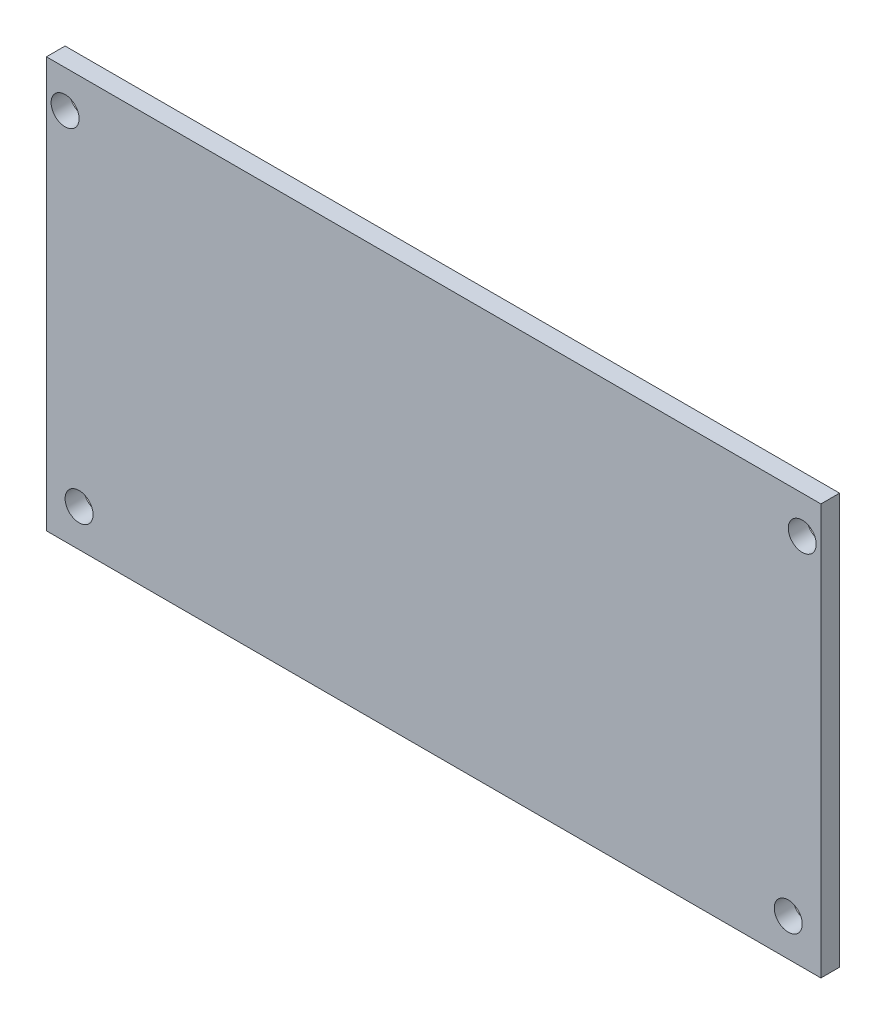
ISO-10303-21;
HEADER;
FILE_DESCRIPTION(('STEP AP214'),'2;1');
FILE_NAME('part.step','',(''),(''),'','','');
FILE_SCHEMA(('AUTOMOTIVE_DESIGN { 1 0 10303 214 1 1 1 1 }'));
ENDSEC;
DATA;
#1=APPLICATION_CONTEXT('core data for automotive mechanical design processes');
#2=APPLICATION_PROTOCOL_DEFINITION('international standard','automotive_design',2000,#1);
#3=PRODUCT_CONTEXT('',#1,'mechanical');
#4=PRODUCT('Part','Part','',(#3));
#5=PRODUCT_RELATED_PRODUCT_CATEGORY('part','',(#4));
#6=PRODUCT_DEFINITION_FORMATION('','',#4);
#7=PRODUCT_DEFINITION_CONTEXT('part definition',#1,'design');
#8=PRODUCT_DEFINITION('design','',#6,#7);
#9=PRODUCT_DEFINITION_SHAPE('','',#8);
#10=(LENGTH_UNIT() NAMED_UNIT(*) SI_UNIT(.MILLI.,.METRE.));
#11=(NAMED_UNIT(*) PLANE_ANGLE_UNIT() SI_UNIT($,.RADIAN.));
#12=(NAMED_UNIT(*) SI_UNIT($,.STERADIAN.) SOLID_ANGLE_UNIT());
#13=UNCERTAINTY_MEASURE_WITH_UNIT(LENGTH_MEASURE(1.E-05),#10,'distance_accuracy_value','');
#14=(GEOMETRIC_REPRESENTATION_CONTEXT(3) GLOBAL_UNCERTAINTY_ASSIGNED_CONTEXT((#13)) GLOBAL_UNIT_ASSIGNED_CONTEXT((#10,
#11,#12)) REPRESENTATION_CONTEXT('',''));
#15=CARTESIAN_POINT('',(0.,0.,0.));
#16=DIRECTION('',(0.,0.,1.));
#17=DIRECTION('',(1.,0.,0.));
#18=AXIS2_PLACEMENT_3D('',#15,#16,#17);
#19=CARTESIAN_POINT('',(0.,44.,2.));
#20=DIRECTION('',(0.,0.,1.));
#21=DIRECTION('',(1.,0.,0.));
#22=AXIS2_PLACEMENT_3D('',#19,#20,#21);
#23=PLANE('',#22);
#24=CARTESIAN_POINT('',(-3.49999999999998,4.00000000000001,2.));
#25=DIRECTION('',(0.,0.,-1.));
#26=DIRECTION('',(-1.,0.,0.));
#27=AXIS2_PLACEMENT_3D('',#24,#25,#26);
#28=CIRCLE('',#27,1.5);
#29=CARTESIAN_POINT('',(-4.99999999999998,4.00000000000001,2.));
#30=VERTEX_POINT('',#29);
#31=EDGE_CURVE('E114',#30,#30,#28,.T.);
#32=ORIENTED_EDGE('',*,*,#31,.T.);
#33=EDGE_LOOP('',(#32));
#34=FACE_BOUND('',#33,.T.);
#35=CARTESIAN_POINT('',(-81.,40.,2.));
#36=DIRECTION('',(0.,0.,-1.));
#37=DIRECTION('',(-1.,0.,0.));
#38=AXIS2_PLACEMENT_3D('',#35,#36,#37);
#39=CIRCLE('',#38,1.5);
#40=CARTESIAN_POINT('',(-82.5,40.,2.));
#41=VERTEX_POINT('',#40);
#42=EDGE_CURVE('E91',#41,#41,#39,.T.);
#43=ORIENTED_EDGE('',*,*,#42,.T.);
#44=EDGE_LOOP('',(#43));
#45=FACE_BOUND('',#44,.T.);
#46=DIRECTION('',(0.,1.,0.));
#47=VECTOR('',#46,1.);
#48=CARTESIAN_POINT('',(0.,0.,2.));
#49=LINE('',#48,#47);
#50=CARTESIAN_POINT('',(0.,0.,2.));
#51=VERTEX_POINT('',#50);
#52=CARTESIAN_POINT('',(0.,44.,2.));
#53=VERTEX_POINT('',#52);
#54=EDGE_CURVE('E99',#51,#53,#49,.T.);
#55=ORIENTED_EDGE('',*,*,#54,.T.);
#56=DIRECTION('',(-1.,0.,0.));
#57=VECTOR('',#56,1.);
#58=CARTESIAN_POINT('',(0.,44.,2.));
#59=LINE('',#58,#57);
#60=CARTESIAN_POINT('',(-83.,44.,2.));
#61=VERTEX_POINT('',#60);
#62=EDGE_CURVE('E83',#53,#61,#59,.T.);
#63=ORIENTED_EDGE('',*,*,#62,.T.);
#64=DIRECTION('',(0.,-1.,0.));
#65=VECTOR('',#64,1.);
#66=CARTESIAN_POINT('',(-83.,0.,2.));
#67=LINE('',#66,#65);
#68=CARTESIAN_POINT('',(-83.,0.,2.));
#69=VERTEX_POINT('',#68);
#70=EDGE_CURVE('E49',#61,#69,#67,.T.);
#71=ORIENTED_EDGE('',*,*,#70,.T.);
#72=DIRECTION('',(1.,0.,0.));
#73=VECTOR('',#72,1.);
#74=CARTESIAN_POINT('',(0.,0.,2.));
#75=LINE('',#74,#73);
#76=EDGE_CURVE('E44',#69,#51,#75,.T.);
#77=ORIENTED_EDGE('',*,*,#76,.T.);
#78=EDGE_LOOP('',(#55,#63,#71,#77));
#79=FACE_BOUND('',#78,.T.);
#80=CARTESIAN_POINT('',(-79.5,4.,2.));
#81=DIRECTION('',(0.,0.,-1.));
#82=DIRECTION('',(-1.,0.,0.));
#83=AXIS2_PLACEMENT_3D('',#80,#81,#82);
#84=CIRCLE('',#83,1.5);
#85=CARTESIAN_POINT('',(-81.,4.,2.));
#86=VERTEX_POINT('',#85);
#87=EDGE_CURVE('E111',#86,#86,#84,.T.);
#88=ORIENTED_EDGE('',*,*,#87,.T.);
#89=EDGE_LOOP('',(#88));
#90=FACE_BOUND('',#89,.T.);
#91=CARTESIAN_POINT('',(-2.,40.,2.));
#92=DIRECTION('',(0.,0.,-1.));
#93=DIRECTION('',(-1.,0.,0.));
#94=AXIS2_PLACEMENT_3D('',#91,#92,#93);
#95=CIRCLE('',#94,1.5);
#96=CARTESIAN_POINT('',(-3.5,40.,2.));
#97=VERTEX_POINT('',#96);
#98=EDGE_CURVE('E123',#97,#97,#95,.T.);
#99=ORIENTED_EDGE('',*,*,#98,.T.);
#100=EDGE_LOOP('',(#99));
#101=FACE_BOUND('',#100,.T.);
#102=ADVANCED_FACE('F27',(#34,#45,#79,#90,#101),#23,.T.);
#103=CARTESIAN_POINT('',(0.,44.,0.));
#104=DIRECTION('',(0.,0.,1.));
#105=DIRECTION('',(1.,0.,0.));
#106=AXIS2_PLACEMENT_3D('',#103,#104,#105);
#107=PLANE('',#106);
#108=CARTESIAN_POINT('',(-3.49999999999998,4.00000000000001,0.));
#109=DIRECTION('',(0.,0.,1.));
#110=DIRECTION('',(1.,0.,0.));
#111=AXIS2_PLACEMENT_3D('',#108,#109,#110);
#112=CIRCLE('',#111,1.5);
#113=CARTESIAN_POINT('',(-1.99999999999997,4.00000000000001,0.));
#114=VERTEX_POINT('',#113);
#115=EDGE_CURVE('E112',#114,#114,#112,.F.);
#116=ORIENTED_EDGE('',*,*,#115,.F.);
#117=EDGE_LOOP('',(#116));
#118=FACE_BOUND('',#117,.T.);
#119=CARTESIAN_POINT('',(-81.,40.,0.));
#120=DIRECTION('',(0.,0.,1.));
#121=DIRECTION('',(1.,0.,0.));
#122=AXIS2_PLACEMENT_3D('',#119,#120,#121);
#123=CIRCLE('',#122,1.5);
#124=CARTESIAN_POINT('',(-79.5,40.,0.));
#125=VERTEX_POINT('',#124);
#126=EDGE_CURVE('E88',#125,#125,#123,.F.);
#127=ORIENTED_EDGE('',*,*,#126,.F.);
#128=EDGE_LOOP('',(#127));
#129=FACE_BOUND('',#128,.T.);
#130=DIRECTION('',(0.,1.,0.));
#131=VECTOR('',#130,1.);
#132=CARTESIAN_POINT('',(0.,0.,0.));
#133=LINE('',#132,#131);
#134=CARTESIAN_POINT('',(0.,0.,0.));
#135=VERTEX_POINT('',#134);
#136=CARTESIAN_POINT('',(0.,44.,0.));
#137=VERTEX_POINT('',#136);
#138=EDGE_CURVE('E75',#135,#137,#133,.T.);
#139=ORIENTED_EDGE('',*,*,#138,.F.);
#140=DIRECTION('',(1.,0.,0.));
#141=VECTOR('',#140,1.);
#142=CARTESIAN_POINT('',(0.,0.,0.));
#143=LINE('',#142,#141);
#144=CARTESIAN_POINT('',(-83.,0.,0.));
#145=VERTEX_POINT('',#144);
#146=EDGE_CURVE('E97',#145,#135,#143,.T.);
#147=ORIENTED_EDGE('',*,*,#146,.F.);
#148=DIRECTION('',(0.,-1.,0.));
#149=VECTOR('',#148,1.);
#150=CARTESIAN_POINT('',(-83.,0.,0.));
#151=LINE('',#150,#149);
#152=CARTESIAN_POINT('',(-83.,44.,0.));
#153=VERTEX_POINT('',#152);
#154=EDGE_CURVE('E76',#153,#145,#151,.T.);
#155=ORIENTED_EDGE('',*,*,#154,.F.);
#156=DIRECTION('',(-1.,0.,0.));
#157=VECTOR('',#156,1.);
#158=CARTESIAN_POINT('',(0.,44.,0.));
#159=LINE('',#158,#157);
#160=EDGE_CURVE('E70',#137,#153,#159,.T.);
#161=ORIENTED_EDGE('',*,*,#160,.F.);
#162=EDGE_LOOP('',(#139,#147,#155,#161));
#163=FACE_BOUND('',#162,.T.);
#164=CARTESIAN_POINT('',(-79.5,4.,0.));
#165=DIRECTION('',(0.,0.,1.));
#166=DIRECTION('',(1.,0.,0.));
#167=AXIS2_PLACEMENT_3D('',#164,#165,#166);
#168=CIRCLE('',#167,1.5);
#169=CARTESIAN_POINT('',(-78.,4.,0.));
#170=VERTEX_POINT('',#169);
#171=EDGE_CURVE('E109',#170,#170,#168,.F.);
#172=ORIENTED_EDGE('',*,*,#171,.F.);
#173=EDGE_LOOP('',(#172));
#174=FACE_BOUND('',#173,.T.);
#175=CARTESIAN_POINT('',(-2.,40.,0.));
#176=DIRECTION('',(0.,0.,1.));
#177=DIRECTION('',(1.,0.,0.));
#178=AXIS2_PLACEMENT_3D('',#175,#176,#177);
#179=CIRCLE('',#178,1.5);
#180=CARTESIAN_POINT('',(-0.5,40.,0.));
#181=VERTEX_POINT('',#180);
#182=EDGE_CURVE('E31',#181,#181,#179,.F.);
#183=ORIENTED_EDGE('',*,*,#182,.F.);
#184=EDGE_LOOP('',(#183));
#185=FACE_BOUND('',#184,.T.);
#186=ADVANCED_FACE('F71',(#118,#129,#163,#174,#185),#107,.F.);
#187=CARTESIAN_POINT('',(0.,0.,2.));
#188=DIRECTION('',(-1.,0.,0.));
#189=DIRECTION('',(0.,0.,1.));
#190=AXIS2_PLACEMENT_3D('',#187,#188,#189);
#191=PLANE('',#190);
#192=ORIENTED_EDGE('',*,*,#138,.T.);
#193=DIRECTION('',(0.,0.,-1.));
#194=VECTOR('',#193,1.);
#195=CARTESIAN_POINT('',(0.,44.,2.));
#196=LINE('',#195,#194);
#197=EDGE_CURVE('E11',#53,#137,#196,.T.);
#198=ORIENTED_EDGE('',*,*,#197,.F.);
#199=ORIENTED_EDGE('',*,*,#54,.F.);
#200=DIRECTION('',(0.,0.,-1.));
#201=VECTOR('',#200,1.);
#202=CARTESIAN_POINT('',(0.,0.,2.));
#203=LINE('',#202,#201);
#204=EDGE_CURVE('E87',#51,#135,#203,.T.);
#205=ORIENTED_EDGE('',*,*,#204,.T.);
#206=EDGE_LOOP('',(#192,#198,#199,#205));
#207=FACE_BOUND('',#206,.T.);
#208=ADVANCED_FACE('F29',(#207),#191,.F.);
#209=CARTESIAN_POINT('',(0.,44.,2.));
#210=DIRECTION('',(0.,-1.,0.));
#211=DIRECTION('',(0.,0.,-1.));
#212=AXIS2_PLACEMENT_3D('',#209,#210,#211);
#213=PLANE('',#212);
#214=ORIENTED_EDGE('',*,*,#160,.T.);
#215=DIRECTION('',(0.,0.,-1.));
#216=VECTOR('',#215,1.);
#217=CARTESIAN_POINT('',(-83.,44.,2.));
#218=LINE('',#217,#216);
#219=EDGE_CURVE('E36',#61,#153,#218,.T.);
#220=ORIENTED_EDGE('',*,*,#219,.F.);
#221=ORIENTED_EDGE('',*,*,#62,.F.);
#222=ORIENTED_EDGE('',*,*,#197,.T.);
#223=EDGE_LOOP('',(#214,#220,#221,#222));
#224=FACE_BOUND('',#223,.T.);
#225=ADVANCED_FACE('F82',(#224),#213,.F.);
#226=CARTESIAN_POINT('',(-83.,0.,2.));
#227=DIRECTION('',(1.,0.,0.));
#228=DIRECTION('',(0.,1.,0.));
#229=AXIS2_PLACEMENT_3D('',#226,#227,#228);
#230=PLANE('',#229);
#231=ORIENTED_EDGE('',*,*,#154,.T.);
#232=DIRECTION('',(0.,0.,-1.));
#233=VECTOR('',#232,1.);
#234=CARTESIAN_POINT('',(-83.,0.,2.));
#235=LINE('',#234,#233);
#236=EDGE_CURVE('E105',#69,#145,#235,.T.);
#237=ORIENTED_EDGE('',*,*,#236,.F.);
#238=ORIENTED_EDGE('',*,*,#70,.F.);
#239=ORIENTED_EDGE('',*,*,#219,.T.);
#240=EDGE_LOOP('',(#231,#237,#238,#239));
#241=FACE_BOUND('',#240,.T.);
#242=ADVANCED_FACE('F153',(#241),#230,.F.);
#243=CARTESIAN_POINT('',(0.,0.,2.));
#244=DIRECTION('',(0.,1.,0.));
#245=DIRECTION('',(-1.,0.,0.));
#246=AXIS2_PLACEMENT_3D('',#243,#244,#245);
#247=PLANE('',#246);
#248=ORIENTED_EDGE('',*,*,#146,.T.);
#249=ORIENTED_EDGE('',*,*,#204,.F.);
#250=ORIENTED_EDGE('',*,*,#76,.F.);
#251=ORIENTED_EDGE('',*,*,#236,.T.);
#252=EDGE_LOOP('',(#248,#249,#250,#251));
#253=FACE_BOUND('',#252,.T.);
#254=ADVANCED_FACE('F150',(#253),#247,.F.);
#255=CARTESIAN_POINT('',(-81.,40.,-8.));
#256=DIRECTION('',(0.,0.,1.));
#257=DIRECTION('',(1.,0.,0.));
#258=AXIS2_PLACEMENT_3D('',#255,#256,#257);
#259=CYLINDRICAL_SURFACE('',#258,1.5);
#260=ORIENTED_EDGE('',*,*,#42,.F.);
#261=EDGE_LOOP('',(#260));
#262=FACE_BOUND('',#261,.T.);
#263=ORIENTED_EDGE('',*,*,#126,.T.);
#264=EDGE_LOOP('',(#263));
#265=FACE_BOUND('',#264,.T.);
#266=ADVANCED_FACE('F147',(#262,#265),#259,.F.);
#267=CARTESIAN_POINT('',(-79.5,4.,-8.));
#268=DIRECTION('',(0.,0.,1.));
#269=DIRECTION('',(1.,0.,0.));
#270=AXIS2_PLACEMENT_3D('',#267,#268,#269);
#271=CYLINDRICAL_SURFACE('',#270,1.5);
#272=ORIENTED_EDGE('',*,*,#87,.F.);
#273=EDGE_LOOP('',(#272));
#274=FACE_BOUND('',#273,.T.);
#275=ORIENTED_EDGE('',*,*,#171,.T.);
#276=EDGE_LOOP('',(#275));
#277=FACE_BOUND('',#276,.T.);
#278=ADVANCED_FACE('F182',(#274,#277),#271,.F.);
#279=CARTESIAN_POINT('',(-3.49999999999998,4.00000000000001,-8.));
#280=DIRECTION('',(0.,0.,1.));
#281=DIRECTION('',(1.,0.,0.));
#282=AXIS2_PLACEMENT_3D('',#279,#280,#281);
#283=CYLINDRICAL_SURFACE('',#282,1.5);
#284=ORIENTED_EDGE('',*,*,#31,.F.);
#285=EDGE_LOOP('',(#284));
#286=FACE_BOUND('',#285,.T.);
#287=ORIENTED_EDGE('',*,*,#115,.T.);
#288=EDGE_LOOP('',(#287));
#289=FACE_BOUND('',#288,.T.);
#290=ADVANCED_FACE('F132',(#286,#289),#283,.F.);
#291=CARTESIAN_POINT('',(-2.,40.,-8.));
#292=DIRECTION('',(0.,0.,1.));
#293=DIRECTION('',(1.,0.,0.));
#294=AXIS2_PLACEMENT_3D('',#291,#292,#293);
#295=CYLINDRICAL_SURFACE('',#294,1.5);
#296=ORIENTED_EDGE('',*,*,#98,.F.);
#297=EDGE_LOOP('',(#296));
#298=FACE_BOUND('',#297,.T.);
#299=ORIENTED_EDGE('',*,*,#182,.T.);
#300=EDGE_LOOP('',(#299));
#301=FACE_BOUND('',#300,.T.);
#302=ADVANCED_FACE('F129',(#298,#301),#295,.F.);
#303=CLOSED_SHELL('',(#102,#186,#208,#225,#242,#254,#266,#278,#290,#302));
#304=MANIFOLD_SOLID_BREP('B2',#303);
#305=ADVANCED_BREP_SHAPE_REPRESENTATION('',(#18,#304),#14);
#306=SHAPE_DEFINITION_REPRESENTATION(#9,#305);
ENDSEC;
END-ISO-10303-21;
